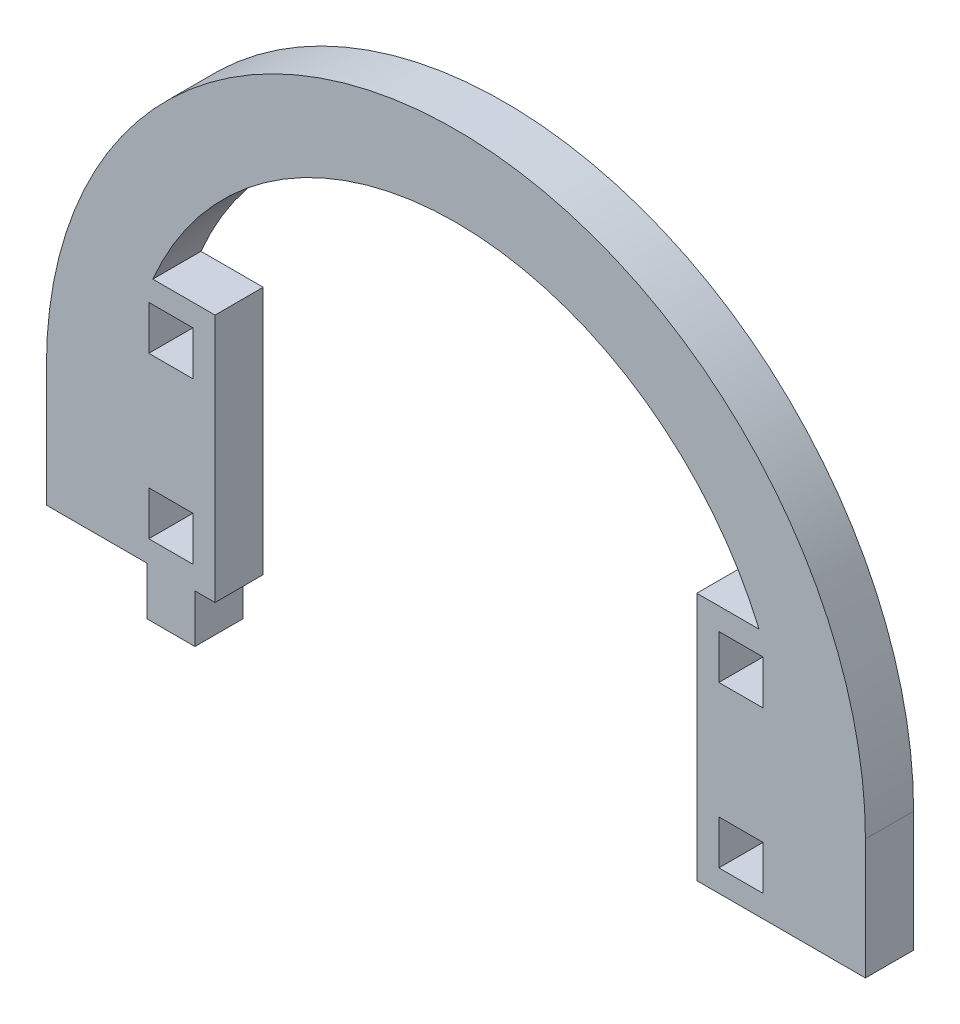
ISO-10303-21;
HEADER;
FILE_DESCRIPTION(('STEP AP214'),'2;1');
FILE_NAME('part.step','',(''),(''),'','','');
FILE_SCHEMA(('AUTOMOTIVE_DESIGN { 1 0 10303 214 1 1 1 1 }'));
ENDSEC;
DATA;
#1=APPLICATION_CONTEXT('core data for automotive mechanical design processes');
#2=APPLICATION_PROTOCOL_DEFINITION('international standard','automotive_design',2000,#1);
#3=PRODUCT_CONTEXT('',#1,'mechanical');
#4=PRODUCT('Part','Part','',(#3));
#5=PRODUCT_RELATED_PRODUCT_CATEGORY('part','',(#4));
#6=PRODUCT_DEFINITION_FORMATION('','',#4);
#7=PRODUCT_DEFINITION_CONTEXT('part definition',#1,'design');
#8=PRODUCT_DEFINITION('design','',#6,#7);
#9=PRODUCT_DEFINITION_SHAPE('','',#8);
#10=(LENGTH_UNIT() NAMED_UNIT(*) SI_UNIT(.MILLI.,.METRE.));
#11=(NAMED_UNIT(*) PLANE_ANGLE_UNIT() SI_UNIT($,.RADIAN.));
#12=(NAMED_UNIT(*) SI_UNIT($,.STERADIAN.) SOLID_ANGLE_UNIT());
#13=UNCERTAINTY_MEASURE_WITH_UNIT(LENGTH_MEASURE(1.E-05),#10,'distance_accuracy_value','');
#14=(GEOMETRIC_REPRESENTATION_CONTEXT(3) GLOBAL_UNCERTAINTY_ASSIGNED_CONTEXT((#13)) GLOBAL_UNIT_ASSIGNED_CONTEXT((#10,
#11,#12)) REPRESENTATION_CONTEXT('',''));
#15=CARTESIAN_POINT('',(0.,0.,0.));
#16=DIRECTION('',(0.,0.,1.));
#17=DIRECTION('',(1.,0.,0.));
#18=AXIS2_PLACEMENT_3D('',#15,#16,#17);
#19=CARTESIAN_POINT('',(3106.22516019874,1463.45795896386,6.));
#20=DIRECTION('',(0.,0.,1.));
#21=DIRECTION('',(1.,0.,0.));
#22=AXIS2_PLACEMENT_3D('',#19,#20,#21);
#23=PLANE('',#22);
#24=CARTESIAN_POINT('',(3106.22516019874,1463.45795896386,6.));
#25=DIRECTION('',(0.,0.,1.));
#26=DIRECTION('',(1.,0.,0.));
#27=AXIS2_PLACEMENT_3D('',#24,#25,#26);
#28=CIRCLE('',#27,50.9999999999999);
#29=CARTESIAN_POINT('',(3157.22516019874,1463.45795896386,6.));
#30=VERTEX_POINT('',#29);
#31=CARTESIAN_POINT('',(3055.22516019874,1463.45795896386,6.));
#32=VERTEX_POINT('',#31);
#33=EDGE_CURVE('E642',#30,#32,#28,.T.);
#34=ORIENTED_EDGE('',*,*,#33,.T.);
#35=DIRECTION('',(0.,-1.,0.));
#36=VECTOR('',#35,1.);
#37=CARTESIAN_POINT('',(3055.22516019874,1463.45795896386,6.));
#38=LINE('',#37,#36);
#39=CARTESIAN_POINT('',(3055.22516019874,1448.45795896386,6.));
#40=VERTEX_POINT('',#39);
#41=EDGE_CURVE('E646',#32,#40,#38,.T.);
#42=ORIENTED_EDGE('',*,*,#41,.T.);
#43=DIRECTION('',(1.,0.,0.));
#44=VECTOR('',#43,1.);
#45=CARTESIAN_POINT('',(3055.22516019874,1448.45795896386,6.));
#46=LINE('',#45,#44);
#47=CARTESIAN_POINT('',(3067.72516019874,1448.45795896386,6.));
#48=VERTEX_POINT('',#47);
#49=EDGE_CURVE('E650',#40,#48,#46,.T.);
#50=ORIENTED_EDGE('',*,*,#49,.T.);
#51=DIRECTION('',(0.,-1.,0.));
#52=VECTOR('',#51,1.);
#53=CARTESIAN_POINT('',(3067.72516019874,1448.45795896386,6.));
#54=LINE('',#53,#52);
#55=CARTESIAN_POINT('',(3067.72516019874,1442.45795896386,6.));
#56=VERTEX_POINT('',#55);
#57=EDGE_CURVE('E653',#48,#56,#54,.T.);
#58=ORIENTED_EDGE('',*,*,#57,.T.);
#59=DIRECTION('',(1.,0.,0.));
#60=VECTOR('',#59,1.);
#61=CARTESIAN_POINT('',(3067.72516019874,1442.45795896386,6.));
#62=LINE('',#61,#60);
#63=CARTESIAN_POINT('',(3073.72516019874,1442.45795896386,6.));
#64=VERTEX_POINT('',#63);
#65=EDGE_CURVE('E656',#56,#64,#62,.T.);
#66=ORIENTED_EDGE('',*,*,#65,.T.);
#67=DIRECTION('',(0.,1.,0.));
#68=VECTOR('',#67,1.);
#69=CARTESIAN_POINT('',(3073.72516019874,1442.45795896386,6.));
#70=LINE('',#69,#68);
#71=CARTESIAN_POINT('',(3073.72516019874,1448.45795896386,6.));
#72=VERTEX_POINT('',#71);
#73=EDGE_CURVE('E659',#64,#72,#70,.T.);
#74=ORIENTED_EDGE('',*,*,#73,.T.);
#75=DIRECTION('',(1.,0.,0.));
#76=VECTOR('',#75,1.);
#77=CARTESIAN_POINT('',(3073.72516019874,1448.45795896386,6.));
#78=LINE('',#77,#76);
#79=CARTESIAN_POINT('',(3076.22516019874,1448.45795896386,6.));
#80=VERTEX_POINT('',#79);
#81=EDGE_CURVE('E662',#72,#80,#78,.T.);
#82=ORIENTED_EDGE('',*,*,#81,.T.);
#83=DIRECTION('',(0.,-1.,0.));
#84=VECTOR('',#83,1.);
#85=CARTESIAN_POINT('',(3076.22516019874,1479.45795896386,6.));
#86=LINE('',#85,#84);
#87=CARTESIAN_POINT('',(3076.22516019874,1479.45795896386,6.));
#88=VERTEX_POINT('',#87);
#89=EDGE_CURVE('E665',#88,#80,#86,.T.);
#90=ORIENTED_EDGE('',*,*,#89,.F.);
#91=DIRECTION('',(-1.,0.,0.));
#92=VECTOR('',#91,1.);
#93=CARTESIAN_POINT('',(3076.22516019874,1479.45795896386,6.));
#94=LINE('',#93,#92);
#95=CARTESIAN_POINT('',(3068.47598802239,1479.45795896386,6.));
#96=VERTEX_POINT('',#95);
#97=EDGE_CURVE('E669',#88,#96,#94,.T.);
#98=ORIENTED_EDGE('',*,*,#97,.T.);
#99=CARTESIAN_POINT('',(3106.22516019874,1463.45795896386,6.));
#100=DIRECTION('',(0.,0.,1.));
#101=DIRECTION('',(1.,0.,0.));
#102=AXIS2_PLACEMENT_3D('',#99,#100,#101);
#103=CIRCLE('',#102,41.0000000000003);
#104=CARTESIAN_POINT('',(3143.9743323751,1479.45795896386,6.));
#105=VERTEX_POINT('',#104);
#106=EDGE_CURVE('E672',#105,#96,#103,.T.);
#107=ORIENTED_EDGE('',*,*,#106,.F.);
#108=DIRECTION('',(-1.,0.,0.));
#109=VECTOR('',#108,1.);
#110=CARTESIAN_POINT('',(3143.9743323751,1479.45795896386,6.));
#111=LINE('',#110,#109);
#112=CARTESIAN_POINT('',(3136.22516019874,1479.45795896386,6.));
#113=VERTEX_POINT('',#112);
#114=EDGE_CURVE('E676',#105,#113,#111,.T.);
#115=ORIENTED_EDGE('',*,*,#114,.T.);
#116=DIRECTION('',(0.,-1.,0.));
#117=VECTOR('',#116,1.);
#118=CARTESIAN_POINT('',(3136.22516019874,1479.45795896386,6.));
#119=LINE('',#118,#117);
#120=CARTESIAN_POINT('',(3136.22516019874,1448.45795896386,6.));
#121=VERTEX_POINT('',#120);
#122=EDGE_CURVE('E679',#113,#121,#119,.T.);
#123=ORIENTED_EDGE('',*,*,#122,.T.);
#124=DIRECTION('',(1.,0.,0.));
#125=VECTOR('',#124,1.);
#126=CARTESIAN_POINT('',(3136.22516019874,1448.45795896386,6.));
#127=LINE('',#126,#125);
#128=CARTESIAN_POINT('',(3157.22516019874,1448.45795896386,6.));
#129=VERTEX_POINT('',#128);
#130=EDGE_CURVE('E682',#121,#129,#127,.T.);
#131=ORIENTED_EDGE('',*,*,#130,.T.);
#132=DIRECTION('',(0.,-1.,0.));
#133=VECTOR('',#132,1.);
#134=CARTESIAN_POINT('',(3157.22516019874,1463.45795896386,6.));
#135=LINE('',#134,#133);
#136=EDGE_CURVE('E685',#30,#129,#135,.T.);
#137=ORIENTED_EDGE('',*,*,#136,.F.);
#138=EDGE_LOOP('',(#34,#42,#50,#58,#66,#74,#82,#90,#98,#107,#115,#123,#131,#137));
#139=FACE_BOUND('',#138,.T.);
#140=DIRECTION('',(0.,1.,0.));
#141=VECTOR('',#140,1.);
#142=CARTESIAN_POINT('',(3144.47516019875,0.,6.));
#143=LINE('',#142,#141);
#144=CARTESIAN_POINT('',(3144.47516019875,1471.20795896386,6.));
#145=VERTEX_POINT('',#144);
#146=CARTESIAN_POINT('',(3144.47516019875,1476.70795896386,6.));
#147=VERTEX_POINT('',#146);
#148=EDGE_CURVE('E602',#145,#147,#143,.T.);
#149=ORIENTED_EDGE('',*,*,#148,.F.);
#150=DIRECTION('',(1.,0.,0.));
#151=VECTOR('',#150,1.);
#152=CARTESIAN_POINT('',(0.,1471.20795896386,6.));
#153=LINE('',#152,#151);
#154=CARTESIAN_POINT('',(3138.97516019874,1471.20795896386,6.));
#155=VERTEX_POINT('',#154);
#156=EDGE_CURVE('E599',#155,#145,#153,.T.);
#157=ORIENTED_EDGE('',*,*,#156,.F.);
#158=DIRECTION('',(0.,-1.,0.));
#159=VECTOR('',#158,1.);
#160=CARTESIAN_POINT('',(3138.97516019874,0.,6.));
#161=LINE('',#160,#159);
#162=CARTESIAN_POINT('',(3138.97516019874,1476.70795896386,6.));
#163=VERTEX_POINT('',#162);
#164=EDGE_CURVE('E610',#163,#155,#161,.T.);
#165=ORIENTED_EDGE('',*,*,#164,.F.);
#166=DIRECTION('',(-1.,0.,0.));
#167=VECTOR('',#166,1.);
#168=CARTESIAN_POINT('',(0.,1476.70795896386,6.));
#169=LINE('',#168,#167);
#170=EDGE_CURVE('E606',#147,#163,#169,.T.);
#171=ORIENTED_EDGE('',*,*,#170,.F.);
#172=EDGE_LOOP('',(#149,#157,#165,#171));
#173=FACE_BOUND('',#172,.T.);
#174=DIRECTION('',(0.,1.,0.));
#175=VECTOR('',#174,1.);
#176=CARTESIAN_POINT('',(3144.47516019875,0.,6.));
#177=LINE('',#176,#175);
#178=CARTESIAN_POINT('',(3144.47516019875,1451.20795896386,6.));
#179=VERTEX_POINT('',#178);
#180=CARTESIAN_POINT('',(3144.47516019875,1456.70795896386,6.));
#181=VERTEX_POINT('',#180);
#182=EDGE_CURVE('E559',#179,#181,#177,.T.);
#183=ORIENTED_EDGE('',*,*,#182,.F.);
#184=DIRECTION('',(1.,0.,0.));
#185=VECTOR('',#184,1.);
#186=CARTESIAN_POINT('',(0.,1451.20795896386,6.));
#187=LINE('',#186,#185);
#188=CARTESIAN_POINT('',(3138.97516019874,1451.20795896386,6.));
#189=VERTEX_POINT('',#188);
#190=EDGE_CURVE('E556',#189,#179,#187,.T.);
#191=ORIENTED_EDGE('',*,*,#190,.F.);
#192=DIRECTION('',(0.,-1.,0.));
#193=VECTOR('',#192,1.);
#194=CARTESIAN_POINT('',(3138.97516019874,0.,6.));
#195=LINE('',#194,#193);
#196=CARTESIAN_POINT('',(3138.97516019874,1456.70795896386,6.));
#197=VERTEX_POINT('',#196);
#198=EDGE_CURVE('E567',#197,#189,#195,.T.);
#199=ORIENTED_EDGE('',*,*,#198,.F.);
#200=DIRECTION('',(-1.,0.,0.));
#201=VECTOR('',#200,1.);
#202=CARTESIAN_POINT('',(0.,1456.70795896386,6.));
#203=LINE('',#202,#201);
#204=EDGE_CURVE('E563',#181,#197,#203,.T.);
#205=ORIENTED_EDGE('',*,*,#204,.F.);
#206=EDGE_LOOP('',(#183,#191,#199,#205));
#207=FACE_BOUND('',#206,.T.);
#208=DIRECTION('',(0.,-1.,0.));
#209=VECTOR('',#208,1.);
#210=CARTESIAN_POINT('',(3067.97516019874,1476.70795896386,6.));
#211=LINE('',#210,#209);
#212=CARTESIAN_POINT('',(3067.97516019874,1476.70795896386,6.));
#213=VERTEX_POINT('',#212);
#214=CARTESIAN_POINT('',(3067.97516019874,1471.20795896386,6.));
#215=VERTEX_POINT('',#214);
#216=EDGE_CURVE('E516',#213,#215,#211,.T.);
#217=ORIENTED_EDGE('',*,*,#216,.F.);
#218=DIRECTION('',(-1.,0.,0.));
#219=VECTOR('',#218,1.);
#220=CARTESIAN_POINT('',(3073.47516019874,1476.70795896386,6.));
#221=LINE('',#220,#219);
#222=CARTESIAN_POINT('',(3073.47516019874,1476.70795896386,6.));
#223=VERTEX_POINT('',#222);
#224=EDGE_CURVE('E513',#223,#213,#221,.T.);
#225=ORIENTED_EDGE('',*,*,#224,.F.);
#226=DIRECTION('',(0.,1.,0.));
#227=VECTOR('',#226,1.);
#228=CARTESIAN_POINT('',(3073.47516019874,1471.20795896386,6.));
#229=LINE('',#228,#227);
#230=CARTESIAN_POINT('',(3073.47516019874,1471.20795896386,6.));
#231=VERTEX_POINT('',#230);
#232=EDGE_CURVE('E524',#231,#223,#229,.T.);
#233=ORIENTED_EDGE('',*,*,#232,.F.);
#234=DIRECTION('',(1.,0.,0.));
#235=VECTOR('',#234,1.);
#236=CARTESIAN_POINT('',(3067.97516019874,1471.20795896386,6.));
#237=LINE('',#236,#235);
#238=EDGE_CURVE('E520',#215,#231,#237,.T.);
#239=ORIENTED_EDGE('',*,*,#238,.F.);
#240=EDGE_LOOP('',(#217,#225,#233,#239));
#241=FACE_BOUND('',#240,.T.);
#242=DIRECTION('',(-1.,0.,0.));
#243=VECTOR('',#242,1.);
#244=CARTESIAN_POINT('',(3073.47516019874,1456.70795896386,6.));
#245=LINE('',#244,#243);
#246=CARTESIAN_POINT('',(3073.47516019874,1456.70795896386,6.));
#247=VERTEX_POINT('',#246);
#248=CARTESIAN_POINT('',(3067.97516019874,1456.70795896386,6.));
#249=VERTEX_POINT('',#248);
#250=EDGE_CURVE('E474',#247,#249,#245,.T.);
#251=ORIENTED_EDGE('',*,*,#250,.F.);
#252=DIRECTION('',(0.,1.,0.));
#253=VECTOR('',#252,1.);
#254=CARTESIAN_POINT('',(3073.47516019874,1451.20795896386,6.));
#255=LINE('',#254,#253);
#256=CARTESIAN_POINT('',(3073.47516019874,1451.20795896386,6.));
#257=VERTEX_POINT('',#256);
#258=EDGE_CURVE('E465',#257,#247,#255,.T.);
#259=ORIENTED_EDGE('',*,*,#258,.F.);
#260=DIRECTION('',(1.,0.,0.));
#261=VECTOR('',#260,1.);
#262=CARTESIAN_POINT('',(3067.97516019874,1451.20795896386,6.));
#263=LINE('',#262,#261);
#264=CARTESIAN_POINT('',(3067.97516019874,1451.20795896386,6.));
#265=VERTEX_POINT('',#264);
#266=EDGE_CURVE('E491',#265,#257,#263,.T.);
#267=ORIENTED_EDGE('',*,*,#266,.F.);
#268=DIRECTION('',(0.,-1.,0.));
#269=VECTOR('',#268,1.);
#270=CARTESIAN_POINT('',(3067.97516019874,1456.70795896386,6.));
#271=LINE('',#270,#269);
#272=EDGE_CURVE('E487',#249,#265,#271,.T.);
#273=ORIENTED_EDGE('',*,*,#272,.F.);
#274=EDGE_LOOP('',(#251,#259,#267,#273));
#275=FACE_BOUND('',#274,.T.);
#276=ADVANCED_FACE('F267',(#139,#173,#207,#241,#275),#23,.T.);
#277=CARTESIAN_POINT('',(3106.22516019874,1463.45795896386,0.));
#278=DIRECTION('',(0.,0.,1.));
#279=DIRECTION('',(1.,0.,0.));
#280=AXIS2_PLACEMENT_3D('',#277,#278,#279);
#281=PLANE('',#280);
#282=DIRECTION('',(-1.,0.,0.));
#283=VECTOR('',#282,1.);
#284=CARTESIAN_POINT('',(3073.47516019874,1476.70795896386,0.));
#285=LINE('',#284,#283);
#286=CARTESIAN_POINT('',(3073.47516019874,1476.70795896386,0.));
#287=VERTEX_POINT('',#286);
#288=CARTESIAN_POINT('',(3067.97516019874,1476.70795896386,0.));
#289=VERTEX_POINT('',#288);
#290=EDGE_CURVE('E483',#287,#289,#285,.T.);
#291=ORIENTED_EDGE('',*,*,#290,.T.);
#292=DIRECTION('',(0.,-1.,0.));
#293=VECTOR('',#292,1.);
#294=CARTESIAN_POINT('',(3067.97516019874,1476.70795896386,0.));
#295=LINE('',#294,#293);
#296=CARTESIAN_POINT('',(3067.97516019874,1471.20795896386,0.));
#297=VERTEX_POINT('',#296);
#298=EDGE_CURVE('E531',#289,#297,#295,.T.);
#299=ORIENTED_EDGE('',*,*,#298,.T.);
#300=DIRECTION('',(1.,0.,0.));
#301=VECTOR('',#300,1.);
#302=CARTESIAN_POINT('',(3067.97516019874,1471.20795896386,0.));
#303=LINE('',#302,#301);
#304=CARTESIAN_POINT('',(3073.47516019874,1471.20795896386,0.));
#305=VERTEX_POINT('',#304);
#306=EDGE_CURVE('E535',#297,#305,#303,.T.);
#307=ORIENTED_EDGE('',*,*,#306,.T.);
#308=DIRECTION('',(0.,1.,0.));
#309=VECTOR('',#308,1.);
#310=CARTESIAN_POINT('',(3073.47516019874,1471.20795896386,0.));
#311=LINE('',#310,#309);
#312=EDGE_CURVE('E517',#305,#287,#311,.T.);
#313=ORIENTED_EDGE('',*,*,#312,.T.);
#314=EDGE_LOOP('',(#291,#299,#307,#313));
#315=FACE_BOUND('',#314,.T.);
#316=DIRECTION('',(1.,0.,0.));
#317=VECTOR('',#316,1.);
#318=CARTESIAN_POINT('',(0.,1471.20795896386,0.));
#319=LINE('',#318,#317);
#320=CARTESIAN_POINT('',(3138.97516019874,1471.20795896386,0.));
#321=VERTEX_POINT('',#320);
#322=CARTESIAN_POINT('',(3144.47516019875,1471.20795896386,0.));
#323=VERTEX_POINT('',#322);
#324=EDGE_CURVE('E598',#321,#323,#319,.T.);
#325=ORIENTED_EDGE('',*,*,#324,.T.);
#326=DIRECTION('',(0.,1.,0.));
#327=VECTOR('',#326,1.);
#328=CARTESIAN_POINT('',(3144.47516019875,0.,0.));
#329=LINE('',#328,#327);
#330=CARTESIAN_POINT('',(3144.47516019875,1476.70795896386,0.));
#331=VERTEX_POINT('',#330);
#332=EDGE_CURVE('E617',#323,#331,#329,.T.);
#333=ORIENTED_EDGE('',*,*,#332,.T.);
#334=DIRECTION('',(-1.,0.,0.));
#335=VECTOR('',#334,1.);
#336=CARTESIAN_POINT('',(0.,1476.70795896386,0.));
#337=LINE('',#336,#335);
#338=CARTESIAN_POINT('',(3138.97516019874,1476.70795896386,0.));
#339=VERTEX_POINT('',#338);
#340=EDGE_CURVE('E621',#331,#339,#337,.T.);
#341=ORIENTED_EDGE('',*,*,#340,.T.);
#342=DIRECTION('',(0.,-1.,0.));
#343=VECTOR('',#342,1.);
#344=CARTESIAN_POINT('',(3138.97516019874,0.,0.));
#345=LINE('',#344,#343);
#346=EDGE_CURVE('E603',#339,#321,#345,.T.);
#347=ORIENTED_EDGE('',*,*,#346,.T.);
#348=EDGE_LOOP('',(#325,#333,#341,#347));
#349=FACE_BOUND('',#348,.T.);
#350=CARTESIAN_POINT('',(3106.22516019874,1463.45795896386,0.));
#351=DIRECTION('',(0.,0.,1.));
#352=DIRECTION('',(1.,0.,0.));
#353=AXIS2_PLACEMENT_3D('',#350,#351,#352);
#354=CIRCLE('',#353,50.9999999999999);
#355=CARTESIAN_POINT('',(3157.22516019874,1463.45795896386,0.));
#356=VERTEX_POINT('',#355);
#357=CARTESIAN_POINT('',(3055.22516019874,1463.45795896386,0.));
#358=VERTEX_POINT('',#357);
#359=EDGE_CURVE('E641',#356,#358,#354,.T.);
#360=ORIENTED_EDGE('',*,*,#359,.F.);
#361=DIRECTION('',(0.,-1.,0.));
#362=VECTOR('',#361,1.);
#363=CARTESIAN_POINT('',(3157.22516019874,1463.45795896386,0.));
#364=LINE('',#363,#362);
#365=CARTESIAN_POINT('',(3157.22516019874,1448.45795896386,0.));
#366=VERTEX_POINT('',#365);
#367=EDGE_CURVE('E647',#356,#366,#364,.T.);
#368=ORIENTED_EDGE('',*,*,#367,.T.);
#369=DIRECTION('',(-1.,0.,0.));
#370=VECTOR('',#369,1.);
#371=CARTESIAN_POINT('',(3157.22516019874,1448.45795896386,0.));
#372=LINE('',#371,#370);
#373=CARTESIAN_POINT('',(3136.22516019874,1448.45795896386,0.));
#374=VERTEX_POINT('',#373);
#375=EDGE_CURVE('E731',#366,#374,#372,.T.);
#376=ORIENTED_EDGE('',*,*,#375,.T.);
#377=DIRECTION('',(0.,-1.,0.));
#378=VECTOR('',#377,1.);
#379=CARTESIAN_POINT('',(3136.22516019874,1479.45795896386,0.));
#380=LINE('',#379,#378);
#381=CARTESIAN_POINT('',(3136.22516019874,1479.45795896386,0.));
#382=VERTEX_POINT('',#381);
#383=EDGE_CURVE('E727',#382,#374,#380,.T.);
#384=ORIENTED_EDGE('',*,*,#383,.F.);
#385=DIRECTION('',(-1.,0.,0.));
#386=VECTOR('',#385,1.);
#387=CARTESIAN_POINT('',(3143.9743323751,1479.45795896386,0.));
#388=LINE('',#387,#386);
#389=CARTESIAN_POINT('',(3143.9743323751,1479.45795896386,0.));
#390=VERTEX_POINT('',#389);
#391=EDGE_CURVE('E724',#390,#382,#388,.T.);
#392=ORIENTED_EDGE('',*,*,#391,.F.);
#393=CARTESIAN_POINT('',(3106.22516019874,1463.45795896386,0.));
#394=DIRECTION('',(0.,0.,1.));
#395=DIRECTION('',(1.,0.,0.));
#396=AXIS2_PLACEMENT_3D('',#393,#394,#395);
#397=CIRCLE('',#396,41.0000000000003);
#398=CARTESIAN_POINT('',(3068.47598802239,1479.45795896386,0.));
#399=VERTEX_POINT('',#398);
#400=EDGE_CURVE('E720',#390,#399,#397,.T.);
#401=ORIENTED_EDGE('',*,*,#400,.T.);
#402=DIRECTION('',(-1.,0.,0.));
#403=VECTOR('',#402,1.);
#404=CARTESIAN_POINT('',(3076.22516019874,1479.45795896386,0.));
#405=LINE('',#404,#403);
#406=CARTESIAN_POINT('',(3076.22516019874,1479.45795896386,0.));
#407=VERTEX_POINT('',#406);
#408=EDGE_CURVE('E716',#407,#399,#405,.T.);
#409=ORIENTED_EDGE('',*,*,#408,.F.);
#410=DIRECTION('',(0.,-1.,0.));
#411=VECTOR('',#410,1.);
#412=CARTESIAN_POINT('',(3076.22516019874,1479.45795896386,0.));
#413=LINE('',#412,#411);
#414=CARTESIAN_POINT('',(3076.22516019874,1448.45795896386,0.));
#415=VERTEX_POINT('',#414);
#416=EDGE_CURVE('E712',#407,#415,#413,.T.);
#417=ORIENTED_EDGE('',*,*,#416,.T.);
#418=DIRECTION('',(1.,0.,0.));
#419=VECTOR('',#418,1.);
#420=CARTESIAN_POINT('',(3073.72516019874,1448.45795896386,0.));
#421=LINE('',#420,#419);
#422=CARTESIAN_POINT('',(3073.72516019874,1448.45795896386,0.));
#423=VERTEX_POINT('',#422);
#424=EDGE_CURVE('E708',#423,#415,#421,.T.);
#425=ORIENTED_EDGE('',*,*,#424,.F.);
#426=DIRECTION('',(0.,1.,0.));
#427=VECTOR('',#426,1.);
#428=CARTESIAN_POINT('',(3073.72516019874,1442.45795896386,0.));
#429=LINE('',#428,#427);
#430=CARTESIAN_POINT('',(3073.72516019874,1442.45795896386,0.));
#431=VERTEX_POINT('',#430);
#432=EDGE_CURVE('E705',#431,#423,#429,.T.);
#433=ORIENTED_EDGE('',*,*,#432,.F.);
#434=DIRECTION('',(1.,0.,0.));
#435=VECTOR('',#434,1.);
#436=CARTESIAN_POINT('',(3067.72516019874,1442.45795896386,0.));
#437=LINE('',#436,#435);
#438=CARTESIAN_POINT('',(3067.72516019874,1442.45795896386,0.));
#439=VERTEX_POINT('',#438);
#440=EDGE_CURVE('E702',#439,#431,#437,.T.);
#441=ORIENTED_EDGE('',*,*,#440,.F.);
#442=DIRECTION('',(0.,-1.,0.));
#443=VECTOR('',#442,1.);
#444=CARTESIAN_POINT('',(3067.72516019874,1448.45795896386,0.));
#445=LINE('',#444,#443);
#446=CARTESIAN_POINT('',(3067.72516019874,1448.45795896386,0.));
#447=VERTEX_POINT('',#446);
#448=EDGE_CURVE('E699',#447,#439,#445,.T.);
#449=ORIENTED_EDGE('',*,*,#448,.F.);
#450=DIRECTION('',(1.,0.,0.));
#451=VECTOR('',#450,1.);
#452=CARTESIAN_POINT('',(3055.22516019874,1448.45795896386,0.));
#453=LINE('',#452,#451);
#454=CARTESIAN_POINT('',(3055.22516019874,1448.45795896386,0.));
#455=VERTEX_POINT('',#454);
#456=EDGE_CURVE('E696',#455,#447,#453,.T.);
#457=ORIENTED_EDGE('',*,*,#456,.F.);
#458=DIRECTION('',(0.,-1.,0.));
#459=VECTOR('',#458,1.);
#460=CARTESIAN_POINT('',(3055.22516019874,1463.45795896386,0.));
#461=LINE('',#460,#459);
#462=EDGE_CURVE('E693',#358,#455,#461,.T.);
#463=ORIENTED_EDGE('',*,*,#462,.F.);
#464=EDGE_LOOP('',(#360,#368,#376,#384,#392,#401,#409,#417,#425,#433,#441,#449,#457,#463));
#465=FACE_BOUND('',#464,.T.);
#466=DIRECTION('',(1.,0.,0.));
#467=VECTOR('',#466,1.);
#468=CARTESIAN_POINT('',(0.,1451.20795896386,0.));
#469=LINE('',#468,#467);
#470=CARTESIAN_POINT('',(3138.97516019874,1451.20795896386,0.));
#471=VERTEX_POINT('',#470);
#472=CARTESIAN_POINT('',(3144.47516019875,1451.20795896386,0.));
#473=VERTEX_POINT('',#472);
#474=EDGE_CURVE('E555',#471,#473,#469,.T.);
#475=ORIENTED_EDGE('',*,*,#474,.T.);
#476=DIRECTION('',(0.,1.,0.));
#477=VECTOR('',#476,1.);
#478=CARTESIAN_POINT('',(3144.47516019875,0.,0.));
#479=LINE('',#478,#477);
#480=CARTESIAN_POINT('',(3144.47516019875,1456.70795896386,0.));
#481=VERTEX_POINT('',#480);
#482=EDGE_CURVE('E574',#473,#481,#479,.T.);
#483=ORIENTED_EDGE('',*,*,#482,.T.);
#484=DIRECTION('',(-1.,0.,0.));
#485=VECTOR('',#484,1.);
#486=CARTESIAN_POINT('',(0.,1456.70795896386,0.));
#487=LINE('',#486,#485);
#488=CARTESIAN_POINT('',(3138.97516019874,1456.70795896386,0.));
#489=VERTEX_POINT('',#488);
#490=EDGE_CURVE('E578',#481,#489,#487,.T.);
#491=ORIENTED_EDGE('',*,*,#490,.T.);
#492=DIRECTION('',(0.,-1.,0.));
#493=VECTOR('',#492,1.);
#494=CARTESIAN_POINT('',(3138.97516019874,0.,0.));
#495=LINE('',#494,#493);
#496=EDGE_CURVE('E560',#489,#471,#495,.T.);
#497=ORIENTED_EDGE('',*,*,#496,.T.);
#498=EDGE_LOOP('',(#475,#483,#491,#497));
#499=FACE_BOUND('',#498,.T.);
#500=DIRECTION('',(0.,1.,0.));
#501=VECTOR('',#500,1.);
#502=CARTESIAN_POINT('',(3073.47516019874,1451.20795896386,0.));
#503=LINE('',#502,#501);
#504=CARTESIAN_POINT('',(3073.47516019874,1451.20795896386,0.));
#505=VERTEX_POINT('',#504);
#506=CARTESIAN_POINT('',(3073.47516019874,1456.70795896386,0.));
#507=VERTEX_POINT('',#506);
#508=EDGE_CURVE('E291',#505,#507,#503,.T.);
#509=ORIENTED_EDGE('',*,*,#508,.T.);
#510=DIRECTION('',(-1.,0.,0.));
#511=VECTOR('',#510,1.);
#512=CARTESIAN_POINT('',(3073.47516019874,1456.70795896386,0.));
#513=LINE('',#512,#511);
#514=CARTESIAN_POINT('',(3067.97516019874,1456.70795896386,0.));
#515=VERTEX_POINT('',#514);
#516=EDGE_CURVE('E481',#507,#515,#513,.T.);
#517=ORIENTED_EDGE('',*,*,#516,.T.);
#518=DIRECTION('',(0.,-1.,0.));
#519=VECTOR('',#518,1.);
#520=CARTESIAN_POINT('',(3067.97516019874,1456.70795896386,0.));
#521=LINE('',#520,#519);
#522=CARTESIAN_POINT('',(3067.97516019874,1451.20795896386,0.));
#523=VERTEX_POINT('',#522);
#524=EDGE_CURVE('E500',#515,#523,#521,.T.);
#525=ORIENTED_EDGE('',*,*,#524,.T.);
#526=DIRECTION('',(1.,0.,0.));
#527=VECTOR('',#526,1.);
#528=CARTESIAN_POINT('',(3067.97516019874,1451.20795896386,0.));
#529=LINE('',#528,#527);
#530=EDGE_CURVE('E475',#523,#505,#529,.T.);
#531=ORIENTED_EDGE('',*,*,#530,.T.);
#532=EDGE_LOOP('',(#509,#517,#525,#531));
#533=FACE_BOUND('',#532,.T.);
#534=ADVANCED_FACE('F789',(#315,#349,#465,#499,#533),#281,.F.);
#535=CARTESIAN_POINT('',(3106.22516019874,1463.45795896386,6.));
#536=DIRECTION('',(0.,0.,-1.));
#537=DIRECTION('',(-1.,0.,0.));
#538=AXIS2_PLACEMENT_3D('',#535,#536,#537);
#539=CYLINDRICAL_SURFACE('',#538,50.9999999999999);
#540=ORIENTED_EDGE('',*,*,#359,.T.);
#541=DIRECTION('',(0.,0.,-1.));
#542=VECTOR('',#541,1.);
#543=CARTESIAN_POINT('',(3055.22516019874,1463.45795896386,6.));
#544=LINE('',#543,#542);
#545=EDGE_CURVE('E12',#32,#358,#544,.T.);
#546=ORIENTED_EDGE('',*,*,#545,.F.);
#547=ORIENTED_EDGE('',*,*,#33,.F.);
#548=DIRECTION('',(0.,0.,-1.));
#549=VECTOR('',#548,1.);
#550=CARTESIAN_POINT('',(3157.22516019874,1463.45795896386,6.));
#551=LINE('',#550,#549);
#552=EDGE_CURVE('E689',#30,#356,#551,.T.);
#553=ORIENTED_EDGE('',*,*,#552,.T.);
#554=EDGE_LOOP('',(#540,#546,#547,#553));
#555=FACE_BOUND('',#554,.T.);
#556=ADVANCED_FACE('F269',(#555),#539,.T.);
#557=CARTESIAN_POINT('',(3055.22516019874,1463.45795896386,6.));
#558=DIRECTION('',(1.,0.,0.));
#559=DIRECTION('',(0.,0.,-1.));
#560=AXIS2_PLACEMENT_3D('',#557,#558,#559);
#561=PLANE('',#560);
#562=ORIENTED_EDGE('',*,*,#462,.T.);
#563=DIRECTION('',(0.,0.,-1.));
#564=VECTOR('',#563,1.);
#565=CARTESIAN_POINT('',(3055.22516019874,1448.45795896386,6.));
#566=LINE('',#565,#564);
#567=EDGE_CURVE('E276',#40,#455,#566,.T.);
#568=ORIENTED_EDGE('',*,*,#567,.F.);
#569=ORIENTED_EDGE('',*,*,#41,.F.);
#570=ORIENTED_EDGE('',*,*,#545,.T.);
#571=EDGE_LOOP('',(#562,#568,#569,#570));
#572=FACE_BOUND('',#571,.T.);
#573=ADVANCED_FACE('F808',(#572),#561,.F.);
#574=CARTESIAN_POINT('',(3055.22516019874,1448.45795896386,6.));
#575=DIRECTION('',(0.,1.,0.));
#576=DIRECTION('',(0.,0.,1.));
#577=AXIS2_PLACEMENT_3D('',#574,#575,#576);
#578=PLANE('',#577);
#579=ORIENTED_EDGE('',*,*,#456,.T.);
#580=DIRECTION('',(0.,0.,-1.));
#581=VECTOR('',#580,1.);
#582=CARTESIAN_POINT('',(3067.72516019874,1448.45795896386,6.));
#583=LINE('',#582,#581);
#584=EDGE_CURVE('E774',#48,#447,#583,.T.);
#585=ORIENTED_EDGE('',*,*,#584,.F.);
#586=ORIENTED_EDGE('',*,*,#49,.F.);
#587=ORIENTED_EDGE('',*,*,#567,.T.);
#588=EDGE_LOOP('',(#579,#585,#586,#587));
#589=FACE_BOUND('',#588,.T.);
#590=ADVANCED_FACE('F783',(#589),#578,.F.);
#591=CARTESIAN_POINT('',(3067.72516019874,1448.45795896386,6.));
#592=DIRECTION('',(1.,0.,0.));
#593=DIRECTION('',(0.,0.,-1.));
#594=AXIS2_PLACEMENT_3D('',#591,#592,#593);
#595=PLANE('',#594);
#596=ORIENTED_EDGE('',*,*,#448,.T.);
#597=DIRECTION('',(0.,0.,-1.));
#598=VECTOR('',#597,1.);
#599=CARTESIAN_POINT('',(3067.72516019874,1442.45795896386,6.));
#600=LINE('',#599,#598);
#601=EDGE_CURVE('E770',#56,#439,#600,.T.);
#602=ORIENTED_EDGE('',*,*,#601,.F.);
#603=ORIENTED_EDGE('',*,*,#57,.F.);
#604=ORIENTED_EDGE('',*,*,#584,.T.);
#605=EDGE_LOOP('',(#596,#602,#603,#604));
#606=FACE_BOUND('',#605,.T.);
#607=ADVANCED_FACE('F795',(#606),#595,.F.);
#608=CARTESIAN_POINT('',(3067.72516019874,1442.45795896386,6.));
#609=DIRECTION('',(0.,1.,0.));
#610=DIRECTION('',(0.,0.,1.));
#611=AXIS2_PLACEMENT_3D('',#608,#609,#610);
#612=PLANE('',#611);
#613=ORIENTED_EDGE('',*,*,#440,.T.);
#614=DIRECTION('',(0.,0.,-1.));
#615=VECTOR('',#614,1.);
#616=CARTESIAN_POINT('',(3073.72516019874,1442.45795896386,6.));
#617=LINE('',#616,#615);
#618=EDGE_CURVE('E766',#64,#431,#617,.T.);
#619=ORIENTED_EDGE('',*,*,#618,.F.);
#620=ORIENTED_EDGE('',*,*,#65,.F.);
#621=ORIENTED_EDGE('',*,*,#601,.T.);
#622=EDGE_LOOP('',(#613,#619,#620,#621));
#623=FACE_BOUND('',#622,.T.);
#624=ADVANCED_FACE('F799',(#623),#612,.F.);
#625=CARTESIAN_POINT('',(3073.72516019874,1442.45795896386,6.));
#626=DIRECTION('',(-1.,0.,0.));
#627=DIRECTION('',(0.,0.,1.));
#628=AXIS2_PLACEMENT_3D('',#625,#626,#627);
#629=PLANE('',#628);
#630=ORIENTED_EDGE('',*,*,#432,.T.);
#631=DIRECTION('',(0.,0.,-1.));
#632=VECTOR('',#631,1.);
#633=CARTESIAN_POINT('',(3073.72516019874,1448.45795896386,6.));
#634=LINE('',#633,#632);
#635=EDGE_CURVE('E762',#72,#423,#634,.T.);
#636=ORIENTED_EDGE('',*,*,#635,.F.);
#637=ORIENTED_EDGE('',*,*,#73,.F.);
#638=ORIENTED_EDGE('',*,*,#618,.T.);
#639=EDGE_LOOP('',(#630,#636,#637,#638));
#640=FACE_BOUND('',#639,.T.);
#641=ADVANCED_FACE('F847',(#640),#629,.F.);
#642=CARTESIAN_POINT('',(3073.72516019874,1448.45795896386,6.));
#643=DIRECTION('',(0.,1.,0.));
#644=DIRECTION('',(0.,0.,1.));
#645=AXIS2_PLACEMENT_3D('',#642,#643,#644);
#646=PLANE('',#645);
#647=ORIENTED_EDGE('',*,*,#424,.T.);
#648=DIRECTION('',(0.,0.,-1.));
#649=VECTOR('',#648,1.);
#650=CARTESIAN_POINT('',(3076.22516019874,1448.45795896386,6.));
#651=LINE('',#650,#649);
#652=EDGE_CURVE('E759',#80,#415,#651,.T.);
#653=ORIENTED_EDGE('',*,*,#652,.F.);
#654=ORIENTED_EDGE('',*,*,#81,.F.);
#655=ORIENTED_EDGE('',*,*,#635,.T.);
#656=EDGE_LOOP('',(#647,#653,#654,#655));
#657=FACE_BOUND('',#656,.T.);
#658=ADVANCED_FACE('F845',(#657),#646,.F.);
#659=CARTESIAN_POINT('',(3076.22516019874,1479.45795896386,6.));
#660=DIRECTION('',(1.,0.,0.));
#661=DIRECTION('',(0.,0.,-1.));
#662=AXIS2_PLACEMENT_3D('',#659,#660,#661);
#663=PLANE('',#662);
#664=ORIENTED_EDGE('',*,*,#416,.F.);
#665=DIRECTION('',(0.,0.,-1.));
#666=VECTOR('',#665,1.);
#667=CARTESIAN_POINT('',(3076.22516019874,1479.45795896386,6.));
#668=LINE('',#667,#666);
#669=EDGE_CURVE('E756',#88,#407,#668,.T.);
#670=ORIENTED_EDGE('',*,*,#669,.F.);
#671=ORIENTED_EDGE('',*,*,#89,.T.);
#672=ORIENTED_EDGE('',*,*,#652,.T.);
#673=EDGE_LOOP('',(#664,#670,#671,#672));
#674=FACE_BOUND('',#673,.T.);
#675=ADVANCED_FACE('F840',(#674),#663,.T.);
#676=CARTESIAN_POINT('',(3076.22516019874,1479.45795896386,6.));
#677=DIRECTION('',(0.,-1.,0.));
#678=DIRECTION('',(0.,0.,-1.));
#679=AXIS2_PLACEMENT_3D('',#676,#677,#678);
#680=PLANE('',#679);
#681=ORIENTED_EDGE('',*,*,#408,.T.);
#682=DIRECTION('',(0.,0.,-1.));
#683=VECTOR('',#682,1.);
#684=CARTESIAN_POINT('',(3068.47598802239,1479.45795896386,6.));
#685=LINE('',#684,#683);
#686=EDGE_CURVE('E753',#96,#399,#685,.T.);
#687=ORIENTED_EDGE('',*,*,#686,.F.);
#688=ORIENTED_EDGE('',*,*,#97,.F.);
#689=ORIENTED_EDGE('',*,*,#669,.T.);
#690=EDGE_LOOP('',(#681,#687,#688,#689));
#691=FACE_BOUND('',#690,.T.);
#692=ADVANCED_FACE('F836',(#691),#680,.F.);
#693=CARTESIAN_POINT('',(3106.22516019874,1463.45795896386,6.));
#694=DIRECTION('',(0.,0.,-1.));
#695=DIRECTION('',(-1.,0.,0.));
#696=AXIS2_PLACEMENT_3D('',#693,#694,#695);
#697=CYLINDRICAL_SURFACE('',#696,41.0000000000003);
#698=ORIENTED_EDGE('',*,*,#400,.F.);
#699=DIRECTION('',(0.,0.,-1.));
#700=VECTOR('',#699,1.);
#701=CARTESIAN_POINT('',(3143.9743323751,1479.45795896386,6.));
#702=LINE('',#701,#700);
#703=EDGE_CURVE('E750',#105,#390,#702,.T.);
#704=ORIENTED_EDGE('',*,*,#703,.F.);
#705=ORIENTED_EDGE('',*,*,#106,.T.);
#706=ORIENTED_EDGE('',*,*,#686,.T.);
#707=EDGE_LOOP('',(#698,#704,#705,#706));
#708=FACE_BOUND('',#707,.T.);
#709=ADVANCED_FACE('F832',(#708),#697,.F.);
#710=CARTESIAN_POINT('',(3143.9743323751,1479.45795896386,6.));
#711=DIRECTION('',(0.,-1.,0.));
#712=DIRECTION('',(0.,0.,-1.));
#713=AXIS2_PLACEMENT_3D('',#710,#711,#712);
#714=PLANE('',#713);
#715=ORIENTED_EDGE('',*,*,#391,.T.);
#716=DIRECTION('',(0.,0.,-1.));
#717=VECTOR('',#716,1.);
#718=CARTESIAN_POINT('',(3136.22516019874,1479.45795896386,6.));
#719=LINE('',#718,#717);
#720=EDGE_CURVE('E746',#113,#382,#719,.T.);
#721=ORIENTED_EDGE('',*,*,#720,.F.);
#722=ORIENTED_EDGE('',*,*,#114,.F.);
#723=ORIENTED_EDGE('',*,*,#703,.T.);
#724=EDGE_LOOP('',(#715,#721,#722,#723));
#725=FACE_BOUND('',#724,.T.);
#726=ADVANCED_FACE('F827',(#725),#714,.F.);
#727=CARTESIAN_POINT('',(3136.22516019874,1479.45795896386,6.));
#728=DIRECTION('',(1.,0.,0.));
#729=DIRECTION('',(0.,0.,-1.));
#730=AXIS2_PLACEMENT_3D('',#727,#728,#729);
#731=PLANE('',#730);
#732=ORIENTED_EDGE('',*,*,#383,.T.);
#733=DIRECTION('',(0.,0.,-1.));
#734=VECTOR('',#733,1.);
#735=CARTESIAN_POINT('',(3136.22516019874,1448.45795896386,6.));
#736=LINE('',#735,#734);
#737=EDGE_CURVE('E742',#121,#374,#736,.T.);
#738=ORIENTED_EDGE('',*,*,#737,.F.);
#739=ORIENTED_EDGE('',*,*,#122,.F.);
#740=ORIENTED_EDGE('',*,*,#720,.T.);
#741=EDGE_LOOP('',(#732,#738,#739,#740));
#742=FACE_BOUND('',#741,.T.);
#743=ADVANCED_FACE('F822',(#742),#731,.F.);
#744=CARTESIAN_POINT('',(3157.22516019874,1448.45795896386,6.));
#745=DIRECTION('',(0.,-1.,0.));
#746=DIRECTION('',(0.,0.,-1.));
#747=AXIS2_PLACEMENT_3D('',#744,#745,#746);
#748=PLANE('',#747);
#749=ORIENTED_EDGE('',*,*,#375,.F.);
#750=DIRECTION('',(0.,0.,-1.));
#751=VECTOR('',#750,1.);
#752=CARTESIAN_POINT('',(3157.22516019874,1448.45795896386,6.));
#753=LINE('',#752,#751);
#754=EDGE_CURVE('E739',#129,#366,#753,.T.);
#755=ORIENTED_EDGE('',*,*,#754,.F.);
#756=ORIENTED_EDGE('',*,*,#130,.F.);
#757=ORIENTED_EDGE('',*,*,#737,.T.);
#758=EDGE_LOOP('',(#749,#755,#756,#757));
#759=FACE_BOUND('',#758,.T.);
#760=ADVANCED_FACE('F817',(#759),#748,.T.);
#761=CARTESIAN_POINT('',(3157.22516019874,1463.45795896386,6.));
#762=DIRECTION('',(1.,0.,0.));
#763=DIRECTION('',(0.,0.,-1.));
#764=AXIS2_PLACEMENT_3D('',#761,#762,#763);
#765=PLANE('',#764);
#766=ORIENTED_EDGE('',*,*,#367,.F.);
#767=ORIENTED_EDGE('',*,*,#552,.F.);
#768=ORIENTED_EDGE('',*,*,#136,.T.);
#769=ORIENTED_EDGE('',*,*,#754,.T.);
#770=EDGE_LOOP('',(#766,#767,#768,#769));
#771=FACE_BOUND('',#770,.T.);
#772=ADVANCED_FACE('F812',(#771),#765,.T.);
#773=CARTESIAN_POINT('',(0.,1471.20795896386,6.));
#774=DIRECTION('',(0.,1.,0.));
#775=DIRECTION('',(0.,0.,1.));
#776=AXIS2_PLACEMENT_3D('',#773,#774,#775);
#777=PLANE('',#776);
#778=ORIENTED_EDGE('',*,*,#324,.F.);
#779=DIRECTION('',(0.,0.,-1.));
#780=VECTOR('',#779,1.);
#781=CARTESIAN_POINT('',(3138.97516019874,1471.20795896386,6.));
#782=LINE('',#781,#780);
#783=EDGE_CURVE('E613',#155,#321,#782,.T.);
#784=ORIENTED_EDGE('',*,*,#783,.F.);
#785=ORIENTED_EDGE('',*,*,#156,.T.);
#786=DIRECTION('',(0.,0.,-1.));
#787=VECTOR('',#786,1.);
#788=CARTESIAN_POINT('',(3144.47516019875,1471.20795896386,6.));
#789=LINE('',#788,#787);
#790=EDGE_CURVE('E637',#145,#323,#789,.T.);
#791=ORIENTED_EDGE('',*,*,#790,.T.);
#792=EDGE_LOOP('',(#778,#784,#785,#791));
#793=FACE_BOUND('',#792,.T.);
#794=ADVANCED_FACE('F864',(#793),#777,.T.);
#795=CARTESIAN_POINT('',(3144.47516019875,0.,6.));
#796=DIRECTION('',(-1.,0.,0.));
#797=DIRECTION('',(0.,0.,1.));
#798=AXIS2_PLACEMENT_3D('',#795,#796,#797);
#799=PLANE('',#798);
#800=ORIENTED_EDGE('',*,*,#332,.F.);
#801=ORIENTED_EDGE('',*,*,#790,.F.);
#802=ORIENTED_EDGE('',*,*,#148,.T.);
#803=DIRECTION('',(0.,0.,-1.));
#804=VECTOR('',#803,1.);
#805=CARTESIAN_POINT('',(3144.47516019875,1476.70795896386,6.));
#806=LINE('',#805,#804);
#807=EDGE_CURVE('E634',#147,#331,#806,.T.);
#808=ORIENTED_EDGE('',*,*,#807,.T.);
#809=EDGE_LOOP('',(#800,#801,#802,#808));
#810=FACE_BOUND('',#809,.T.);
#811=ADVANCED_FACE('F914',(#810),#799,.T.);
#812=CARTESIAN_POINT('',(0.,1476.70795896386,6.));
#813=DIRECTION('',(0.,-1.,0.));
#814=DIRECTION('',(0.,0.,-1.));
#815=AXIS2_PLACEMENT_3D('',#812,#813,#814);
#816=PLANE('',#815);
#817=ORIENTED_EDGE('',*,*,#340,.F.);
#818=ORIENTED_EDGE('',*,*,#807,.F.);
#819=ORIENTED_EDGE('',*,*,#170,.T.);
#820=DIRECTION('',(0.,0.,-1.));
#821=VECTOR('',#820,1.);
#822=CARTESIAN_POINT('',(3138.97516019874,1476.70795896386,6.));
#823=LINE('',#822,#821);
#824=EDGE_CURVE('E631',#163,#339,#823,.T.);
#825=ORIENTED_EDGE('',*,*,#824,.T.);
#826=EDGE_LOOP('',(#817,#818,#819,#825));
#827=FACE_BOUND('',#826,.T.);
#828=ADVANCED_FACE('F921',(#827),#816,.T.);
#829=CARTESIAN_POINT('',(3138.97516019874,0.,6.));
#830=DIRECTION('',(1.,0.,0.));
#831=DIRECTION('',(0.,0.,-1.));
#832=AXIS2_PLACEMENT_3D('',#829,#830,#831);
#833=PLANE('',#832);
#834=ORIENTED_EDGE('',*,*,#346,.F.);
#835=ORIENTED_EDGE('',*,*,#824,.F.);
#836=ORIENTED_EDGE('',*,*,#164,.T.);
#837=ORIENTED_EDGE('',*,*,#783,.T.);
#838=EDGE_LOOP('',(#834,#835,#836,#837));
#839=FACE_BOUND('',#838,.T.);
#840=ADVANCED_FACE('F928',(#839),#833,.T.);
#841=CARTESIAN_POINT('',(0.,1451.20795896386,6.));
#842=DIRECTION('',(0.,1.,0.));
#843=DIRECTION('',(0.,0.,1.));
#844=AXIS2_PLACEMENT_3D('',#841,#842,#843);
#845=PLANE('',#844);
#846=ORIENTED_EDGE('',*,*,#474,.F.);
#847=DIRECTION('',(0.,0.,-1.));
#848=VECTOR('',#847,1.);
#849=CARTESIAN_POINT('',(3138.97516019874,1451.20795896386,6.));
#850=LINE('',#849,#848);
#851=EDGE_CURVE('E570',#189,#471,#850,.T.);
#852=ORIENTED_EDGE('',*,*,#851,.F.);
#853=ORIENTED_EDGE('',*,*,#190,.T.);
#854=DIRECTION('',(0.,0.,-1.));
#855=VECTOR('',#854,1.);
#856=CARTESIAN_POINT('',(3144.47516019875,1451.20795896386,6.));
#857=LINE('',#856,#855);
#858=EDGE_CURVE('E594',#179,#473,#857,.T.);
#859=ORIENTED_EDGE('',*,*,#858,.T.);
#860=EDGE_LOOP('',(#846,#852,#853,#859));
#861=FACE_BOUND('',#860,.T.);
#862=ADVANCED_FACE('F936',(#861),#845,.T.);
#863=CARTESIAN_POINT('',(3144.47516019875,0.,6.));
#864=DIRECTION('',(-1.,0.,0.));
#865=DIRECTION('',(0.,0.,1.));
#866=AXIS2_PLACEMENT_3D('',#863,#864,#865);
#867=PLANE('',#866);
#868=ORIENTED_EDGE('',*,*,#482,.F.);
#869=ORIENTED_EDGE('',*,*,#858,.F.);
#870=ORIENTED_EDGE('',*,*,#182,.T.);
#871=DIRECTION('',(0.,0.,-1.));
#872=VECTOR('',#871,1.);
#873=CARTESIAN_POINT('',(3144.47516019875,1456.70795896386,6.));
#874=LINE('',#873,#872);
#875=EDGE_CURVE('E591',#181,#481,#874,.T.);
#876=ORIENTED_EDGE('',*,*,#875,.T.);
#877=EDGE_LOOP('',(#868,#869,#870,#876));
#878=FACE_BOUND('',#877,.T.);
#879=ADVANCED_FACE('F944',(#878),#867,.T.);
#880=CARTESIAN_POINT('',(0.,1456.70795896386,6.));
#881=DIRECTION('',(0.,-1.,0.));
#882=DIRECTION('',(0.,0.,-1.));
#883=AXIS2_PLACEMENT_3D('',#880,#881,#882);
#884=PLANE('',#883);
#885=ORIENTED_EDGE('',*,*,#490,.F.);
#886=ORIENTED_EDGE('',*,*,#875,.F.);
#887=ORIENTED_EDGE('',*,*,#204,.T.);
#888=DIRECTION('',(0.,0.,-1.));
#889=VECTOR('',#888,1.);
#890=CARTESIAN_POINT('',(3138.97516019874,1456.70795896386,6.));
#891=LINE('',#890,#889);
#892=EDGE_CURVE('E588',#197,#489,#891,.T.);
#893=ORIENTED_EDGE('',*,*,#892,.T.);
#894=EDGE_LOOP('',(#885,#886,#887,#893));
#895=FACE_BOUND('',#894,.T.);
#896=ADVANCED_FACE('F952',(#895),#884,.T.);
#897=CARTESIAN_POINT('',(3138.97516019874,0.,6.));
#898=DIRECTION('',(1.,0.,0.));
#899=DIRECTION('',(0.,0.,-1.));
#900=AXIS2_PLACEMENT_3D('',#897,#898,#899);
#901=PLANE('',#900);
#902=ORIENTED_EDGE('',*,*,#496,.F.);
#903=ORIENTED_EDGE('',*,*,#892,.F.);
#904=ORIENTED_EDGE('',*,*,#198,.T.);
#905=ORIENTED_EDGE('',*,*,#851,.T.);
#906=EDGE_LOOP('',(#902,#903,#904,#905));
#907=FACE_BOUND('',#906,.T.);
#908=ADVANCED_FACE('F960',(#907),#901,.T.);
#909=CARTESIAN_POINT('',(3073.47516019874,1476.70795896386,6.));
#910=DIRECTION('',(0.,-1.,0.));
#911=DIRECTION('',(0.,0.,-1.));
#912=AXIS2_PLACEMENT_3D('',#909,#910,#911);
#913=PLANE('',#912);
#914=ORIENTED_EDGE('',*,*,#290,.F.);
#915=DIRECTION('',(0.,0.,-1.));
#916=VECTOR('',#915,1.);
#917=CARTESIAN_POINT('',(3073.47516019874,1476.70795896386,6.));
#918=LINE('',#917,#916);
#919=EDGE_CURVE('E527',#223,#287,#918,.T.);
#920=ORIENTED_EDGE('',*,*,#919,.F.);
#921=ORIENTED_EDGE('',*,*,#224,.T.);
#922=DIRECTION('',(0.,0.,-1.));
#923=VECTOR('',#922,1.);
#924=CARTESIAN_POINT('',(3067.97516019874,1476.70795896386,6.));
#925=LINE('',#924,#923);
#926=EDGE_CURVE('E551',#213,#289,#925,.T.);
#927=ORIENTED_EDGE('',*,*,#926,.T.);
#928=EDGE_LOOP('',(#914,#920,#921,#927));
#929=FACE_BOUND('',#928,.T.);
#930=ADVANCED_FACE('F968',(#929),#913,.T.);
#931=CARTESIAN_POINT('',(3067.97516019874,1476.70795896386,6.));
#932=DIRECTION('',(1.,0.,0.));
#933=DIRECTION('',(0.,0.,-1.));
#934=AXIS2_PLACEMENT_3D('',#931,#932,#933);
#935=PLANE('',#934);
#936=ORIENTED_EDGE('',*,*,#298,.F.);
#937=ORIENTED_EDGE('',*,*,#926,.F.);
#938=ORIENTED_EDGE('',*,*,#216,.T.);
#939=DIRECTION('',(0.,0.,-1.));
#940=VECTOR('',#939,1.);
#941=CARTESIAN_POINT('',(3067.97516019874,1471.20795896386,6.));
#942=LINE('',#941,#940);
#943=EDGE_CURVE('E548',#215,#297,#942,.T.);
#944=ORIENTED_EDGE('',*,*,#943,.T.);
#945=EDGE_LOOP('',(#936,#937,#938,#944));
#946=FACE_BOUND('',#945,.T.);
#947=ADVANCED_FACE('F976',(#946),#935,.T.);
#948=CARTESIAN_POINT('',(3067.97516019874,1471.20795896386,6.));
#949=DIRECTION('',(0.,1.,0.));
#950=DIRECTION('',(0.,0.,1.));
#951=AXIS2_PLACEMENT_3D('',#948,#949,#950);
#952=PLANE('',#951);
#953=ORIENTED_EDGE('',*,*,#306,.F.);
#954=ORIENTED_EDGE('',*,*,#943,.F.);
#955=ORIENTED_EDGE('',*,*,#238,.T.);
#956=DIRECTION('',(0.,0.,-1.));
#957=VECTOR('',#956,1.);
#958=CARTESIAN_POINT('',(3073.47516019874,1471.20795896386,6.));
#959=LINE('',#958,#957);
#960=EDGE_CURVE('E545',#231,#305,#959,.T.);
#961=ORIENTED_EDGE('',*,*,#960,.T.);
#962=EDGE_LOOP('',(#953,#954,#955,#961));
#963=FACE_BOUND('',#962,.T.);
#964=ADVANCED_FACE('F984',(#963),#952,.T.);
#965=CARTESIAN_POINT('',(3073.47516019874,1471.20795896386,6.));
#966=DIRECTION('',(-1.,0.,0.));
#967=DIRECTION('',(0.,0.,1.));
#968=AXIS2_PLACEMENT_3D('',#965,#966,#967);
#969=PLANE('',#968);
#970=ORIENTED_EDGE('',*,*,#312,.F.);
#971=ORIENTED_EDGE('',*,*,#960,.F.);
#972=ORIENTED_EDGE('',*,*,#232,.T.);
#973=ORIENTED_EDGE('',*,*,#919,.T.);
#974=EDGE_LOOP('',(#970,#971,#972,#973));
#975=FACE_BOUND('',#974,.T.);
#976=ADVANCED_FACE('F992',(#975),#969,.T.);
#977=CARTESIAN_POINT('',(3073.47516019874,1451.20795896386,6.));
#978=DIRECTION('',(-1.,0.,0.));
#979=DIRECTION('',(0.,0.,1.));
#980=AXIS2_PLACEMENT_3D('',#977,#978,#979);
#981=PLANE('',#980);
#982=ORIENTED_EDGE('',*,*,#508,.F.);
#983=DIRECTION('',(0.,0.,-1.));
#984=VECTOR('',#983,1.);
#985=CARTESIAN_POINT('',(3073.47516019874,1451.20795896386,6.));
#986=LINE('',#985,#984);
#987=EDGE_CURVE('E469',#257,#505,#986,.T.);
#988=ORIENTED_EDGE('',*,*,#987,.F.);
#989=ORIENTED_EDGE('',*,*,#258,.T.);
#990=DIRECTION('',(0.,0.,-1.));
#991=VECTOR('',#990,1.);
#992=CARTESIAN_POINT('',(3073.47516019874,1456.70795896386,6.));
#993=LINE('',#992,#991);
#994=EDGE_CURVE('E468',#247,#507,#993,.T.);
#995=ORIENTED_EDGE('',*,*,#994,.T.);
#996=EDGE_LOOP('',(#982,#988,#989,#995));
#997=FACE_BOUND('',#996,.T.);
#998=ADVANCED_FACE('F467',(#997),#981,.T.);
#999=CARTESIAN_POINT('',(3073.47516019874,1456.70795896386,6.));
#1000=DIRECTION('',(0.,-1.,0.));
#1001=DIRECTION('',(0.,0.,-1.));
#1002=AXIS2_PLACEMENT_3D('',#999,#1000,#1001);
#1003=PLANE('',#1002);
#1004=ORIENTED_EDGE('',*,*,#516,.F.);
#1005=ORIENTED_EDGE('',*,*,#994,.F.);
#1006=ORIENTED_EDGE('',*,*,#250,.T.);
#1007=DIRECTION('',(0.,0.,-1.));
#1008=VECTOR('',#1007,1.);
#1009=CARTESIAN_POINT('',(3067.97516019874,1456.70795896386,6.));
#1010=LINE('',#1009,#1008);
#1011=EDGE_CURVE('E484',#249,#515,#1010,.T.);
#1012=ORIENTED_EDGE('',*,*,#1011,.T.);
#1013=EDGE_LOOP('',(#1004,#1005,#1006,#1012));
#1014=FACE_BOUND('',#1013,.T.);
#1015=ADVANCED_FACE('F478',(#1014),#1003,.T.);
#1016=CARTESIAN_POINT('',(3067.97516019874,1456.70795896386,6.));
#1017=DIRECTION('',(1.,0.,0.));
#1018=DIRECTION('',(0.,0.,-1.));
#1019=AXIS2_PLACEMENT_3D('',#1016,#1017,#1018);
#1020=PLANE('',#1019);
#1021=ORIENTED_EDGE('',*,*,#524,.F.);
#1022=ORIENTED_EDGE('',*,*,#1011,.F.);
#1023=ORIENTED_EDGE('',*,*,#272,.T.);
#1024=DIRECTION('',(0.,0.,-1.));
#1025=VECTOR('',#1024,1.);
#1026=CARTESIAN_POINT('',(3067.97516019874,1451.20795896386,6.));
#1027=LINE('',#1026,#1025);
#1028=EDGE_CURVE('E283',#265,#523,#1027,.T.);
#1029=ORIENTED_EDGE('',*,*,#1028,.T.);
#1030=EDGE_LOOP('',(#1021,#1022,#1023,#1029));
#1031=FACE_BOUND('',#1030,.T.);
#1032=ADVANCED_FACE('F1013',(#1031),#1020,.T.);
#1033=CARTESIAN_POINT('',(3067.97516019874,1451.20795896386,6.));
#1034=DIRECTION('',(0.,1.,0.));
#1035=DIRECTION('',(0.,0.,1.));
#1036=AXIS2_PLACEMENT_3D('',#1033,#1034,#1035);
#1037=PLANE('',#1036);
#1038=ORIENTED_EDGE('',*,*,#530,.F.);
#1039=ORIENTED_EDGE('',*,*,#1028,.F.);
#1040=ORIENTED_EDGE('',*,*,#266,.T.);
#1041=ORIENTED_EDGE('',*,*,#987,.T.);
#1042=EDGE_LOOP('',(#1038,#1039,#1040,#1041));
#1043=FACE_BOUND('',#1042,.T.);
#1044=ADVANCED_FACE('F1020',(#1043),#1037,.T.);
#1045=CLOSED_SHELL('',(#276,#534,#556,#573,#590,#607,#624,#641,#658,#675,#692,#709,#726,#743,
#760,#772,#794,#811,#828,#840,#862,#879,#896,#908,#930,#947,#964,#976,#998,#1015,#1032,#1044));
#1046=MANIFOLD_SOLID_BREP('B2',#1045);
#1047=ADVANCED_BREP_SHAPE_REPRESENTATION('',(#18,#1046),#14);
#1048=SHAPE_DEFINITION_REPRESENTATION(#9,#1047);
ENDSEC;
END-ISO-10303-21;
